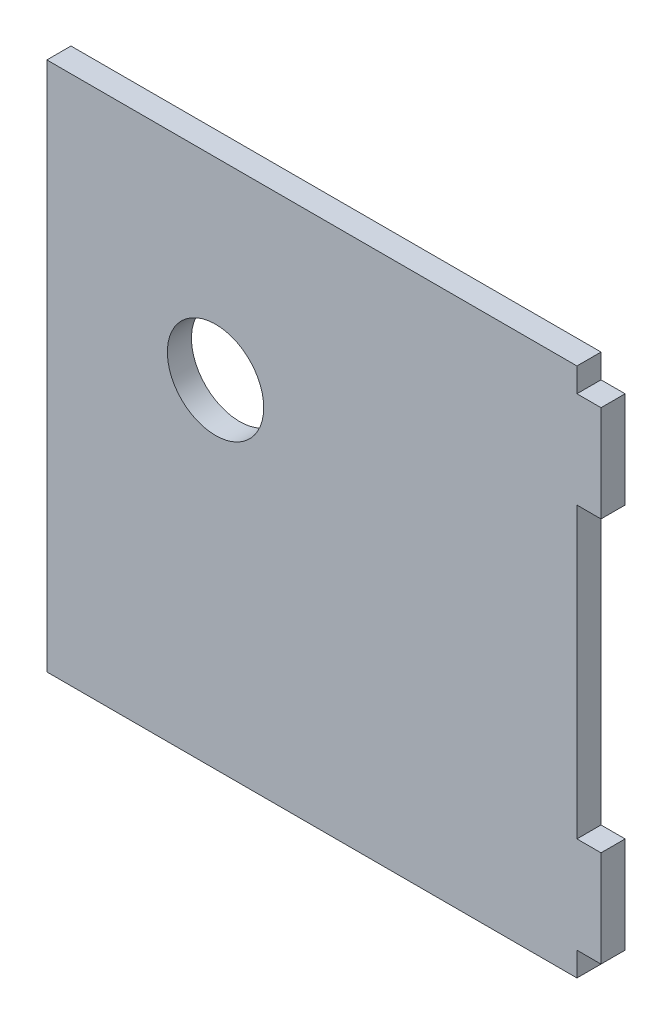
ISO-10303-21;
HEADER;
FILE_DESCRIPTION(('STEP AP214'),'2;1');
FILE_NAME('part.step','',(''),(''),'','','');
FILE_SCHEMA(('AUTOMOTIVE_DESIGN { 1 0 10303 214 1 1 1 1 }'));
ENDSEC;
DATA;
#1=APPLICATION_CONTEXT('core data for automotive mechanical design processes');
#2=APPLICATION_PROTOCOL_DEFINITION('international standard','automotive_design',2000,#1);
#3=PRODUCT_CONTEXT('',#1,'mechanical');
#4=PRODUCT('Part','Part','',(#3));
#5=PRODUCT_RELATED_PRODUCT_CATEGORY('part','',(#4));
#6=PRODUCT_DEFINITION_FORMATION('','',#4);
#7=PRODUCT_DEFINITION_CONTEXT('part definition',#1,'design');
#8=PRODUCT_DEFINITION('design','',#6,#7);
#9=PRODUCT_DEFINITION_SHAPE('','',#8);
#10=(LENGTH_UNIT() NAMED_UNIT(*) SI_UNIT(.MILLI.,.METRE.));
#11=(NAMED_UNIT(*) PLANE_ANGLE_UNIT() SI_UNIT($,.RADIAN.));
#12=(NAMED_UNIT(*) SI_UNIT($,.STERADIAN.) SOLID_ANGLE_UNIT());
#13=UNCERTAINTY_MEASURE_WITH_UNIT(LENGTH_MEASURE(1.E-05),#10,'distance_accuracy_value','');
#14=(GEOMETRIC_REPRESENTATION_CONTEXT(3) GLOBAL_UNCERTAINTY_ASSIGNED_CONTEXT((#13)) GLOBAL_UNIT_ASSIGNED_CONTEXT((#10,
#11,#12)) REPRESENTATION_CONTEXT('',''));
#15=CARTESIAN_POINT('',(0.,0.,0.));
#16=DIRECTION('',(0.,0.,1.));
#17=DIRECTION('',(1.,0.,0.));
#18=AXIS2_PLACEMENT_3D('',#15,#16,#17);
#19=CARTESIAN_POINT('',(0.,0.,6.35));
#20=DIRECTION('',(0.,0.,-1.));
#21=DIRECTION('',(-1.,0.,0.));
#22=AXIS2_PLACEMENT_3D('',#19,#20,#21);
#23=PLANE('',#22);
#24=DIRECTION('',(0.,-1.,0.));
#25=VECTOR('',#24,1.);
#26=CARTESIAN_POINT('',(0.,0.,6.35));
#27=LINE('',#26,#25);
#28=CARTESIAN_POINT('',(0.,139.7,6.35));
#29=VERTEX_POINT('',#28);
#30=CARTESIAN_POINT('',(0.,0.,6.35));
#31=VERTEX_POINT('',#30);
#32=EDGE_CURVE('E177',#29,#31,#27,.T.);
#33=ORIENTED_EDGE('',*,*,#32,.T.);
#34=DIRECTION('',(1.,0.,0.));
#35=VECTOR('',#34,1.);
#36=CARTESIAN_POINT('',(0.,0.,6.35));
#37=LINE('',#36,#35);
#38=CARTESIAN_POINT('',(139.7,0.,6.35));
#39=VERTEX_POINT('',#38);
#40=EDGE_CURVE('E105',#31,#39,#37,.T.);
#41=ORIENTED_EDGE('',*,*,#40,.T.);
#42=DIRECTION('',(0.,1.,0.));
#43=VECTOR('',#42,1.);
#44=CARTESIAN_POINT('',(139.7,0.,6.35));
#45=LINE('',#44,#43);
#46=CARTESIAN_POINT('',(139.7,6.35,6.35));
#47=VERTEX_POINT('',#46);
#48=EDGE_CURVE('E204',#39,#47,#45,.T.);
#49=ORIENTED_EDGE('',*,*,#48,.T.);
#50=DIRECTION('',(1.,0.,0.));
#51=VECTOR('',#50,1.);
#52=CARTESIAN_POINT('',(139.7,6.35,6.35));
#53=LINE('',#52,#51);
#54=CARTESIAN_POINT('',(146.05,6.35,6.35));
#55=VERTEX_POINT('',#54);
#56=EDGE_CURVE('E223',#47,#55,#53,.T.);
#57=ORIENTED_EDGE('',*,*,#56,.T.);
#58=DIRECTION('',(0.,1.,0.));
#59=VECTOR('',#58,1.);
#60=CARTESIAN_POINT('',(146.05,6.35,6.35));
#61=LINE('',#60,#59);
#62=CARTESIAN_POINT('',(146.05,31.75,6.35));
#63=VERTEX_POINT('',#62);
#64=EDGE_CURVE('E220',#55,#63,#61,.T.);
#65=ORIENTED_EDGE('',*,*,#64,.T.);
#66=DIRECTION('',(-1.,0.,0.));
#67=VECTOR('',#66,1.);
#68=CARTESIAN_POINT('',(146.05,31.75,6.35));
#69=LINE('',#68,#67);
#70=CARTESIAN_POINT('',(139.7,31.75,6.35));
#71=VERTEX_POINT('',#70);
#72=EDGE_CURVE('E222',#63,#71,#69,.T.);
#73=ORIENTED_EDGE('',*,*,#72,.T.);
#74=DIRECTION('',(0.,1.,0.));
#75=VECTOR('',#74,1.);
#76=CARTESIAN_POINT('',(139.7,107.95,6.35));
#77=LINE('',#76,#75);
#78=CARTESIAN_POINT('',(139.7,107.95,6.35));
#79=VERTEX_POINT('',#78);
#80=EDGE_CURVE('E225',#71,#79,#77,.T.);
#81=ORIENTED_EDGE('',*,*,#80,.T.);
#82=DIRECTION('',(1.,0.,0.));
#83=VECTOR('',#82,1.);
#84=CARTESIAN_POINT('',(139.7,107.95,6.35));
#85=LINE('',#84,#83);
#86=CARTESIAN_POINT('',(146.05,107.95,6.35));
#87=VERTEX_POINT('',#86);
#88=EDGE_CURVE('E231',#79,#87,#85,.T.);
#89=ORIENTED_EDGE('',*,*,#88,.T.);
#90=DIRECTION('',(0.,1.,0.));
#91=VECTOR('',#90,1.);
#92=CARTESIAN_POINT('',(146.05,133.35,6.35));
#93=LINE('',#92,#91);
#94=CARTESIAN_POINT('',(146.05,133.35,6.35));
#95=VERTEX_POINT('',#94);
#96=EDGE_CURVE('E136',#87,#95,#93,.T.);
#97=ORIENTED_EDGE('',*,*,#96,.T.);
#98=DIRECTION('',(-1.,0.,0.));
#99=VECTOR('',#98,1.);
#100=CARTESIAN_POINT('',(139.7,133.35,6.35));
#101=LINE('',#100,#99);
#102=CARTESIAN_POINT('',(139.7,133.35,6.35));
#103=VERTEX_POINT('',#102);
#104=EDGE_CURVE('E130',#95,#103,#101,.T.);
#105=ORIENTED_EDGE('',*,*,#104,.T.);
#106=DIRECTION('',(0.,1.,0.));
#107=VECTOR('',#106,1.);
#108=CARTESIAN_POINT('',(139.7,133.35,6.35));
#109=LINE('',#108,#107);
#110=CARTESIAN_POINT('',(139.7,139.7,6.35));
#111=VERTEX_POINT('',#110);
#112=EDGE_CURVE('E134',#103,#111,#109,.T.);
#113=ORIENTED_EDGE('',*,*,#112,.T.);
#114=DIRECTION('',(-1.,0.,0.));
#115=VECTOR('',#114,1.);
#116=CARTESIAN_POINT('',(0.,139.7,6.35));
#117=LINE('',#116,#115);
#118=EDGE_CURVE('E50',#111,#29,#117,.T.);
#119=ORIENTED_EDGE('',*,*,#118,.T.);
#120=EDGE_LOOP('',(#33,#41,#49,#57,#65,#73,#81,#89,#97,#105,#113,#119));
#121=FACE_BOUND('',#120,.T.);
#122=CARTESIAN_POINT('',(44.45,88.9,6.35));
#123=DIRECTION('',(0.,0.,1.));
#124=DIRECTION('',(1.,0.,0.));
#125=AXIS2_PLACEMENT_3D('',#122,#123,#124);
#126=CIRCLE('',#125,12.7);
#127=CARTESIAN_POINT('',(57.15,88.9,6.35));
#128=VERTEX_POINT('',#127);
#129=EDGE_CURVE('E158',#128,#128,#126,.T.);
#130=ORIENTED_EDGE('',*,*,#129,.F.);
#131=EDGE_LOOP('',(#130));
#132=FACE_BOUND('',#131,.T.);
#133=ADVANCED_FACE('F33',(#121,#132),#23,.F.);
#134=CARTESIAN_POINT('',(0.,0.,0.));
#135=DIRECTION('',(0.,0.,-1.));
#136=DIRECTION('',(-1.,0.,0.));
#137=AXIS2_PLACEMENT_3D('',#134,#135,#136);
#138=PLANE('',#137);
#139=DIRECTION('',(0.,-1.,0.));
#140=VECTOR('',#139,1.);
#141=CARTESIAN_POINT('',(0.,0.,0.));
#142=LINE('',#141,#140);
#143=CARTESIAN_POINT('',(0.,139.7,0.));
#144=VERTEX_POINT('',#143);
#145=CARTESIAN_POINT('',(0.,0.,0.));
#146=VERTEX_POINT('',#145);
#147=EDGE_CURVE('E154',#144,#146,#142,.T.);
#148=ORIENTED_EDGE('',*,*,#147,.F.);
#149=DIRECTION('',(-1.,0.,0.));
#150=VECTOR('',#149,1.);
#151=CARTESIAN_POINT('',(0.,139.7,0.));
#152=LINE('',#151,#150);
#153=CARTESIAN_POINT('',(139.7,139.7,0.));
#154=VERTEX_POINT('',#153);
#155=EDGE_CURVE('E97',#154,#144,#152,.T.);
#156=ORIENTED_EDGE('',*,*,#155,.F.);
#157=DIRECTION('',(0.,1.,0.));
#158=VECTOR('',#157,1.);
#159=CARTESIAN_POINT('',(139.7,133.35,0.));
#160=LINE('',#159,#158);
#161=CARTESIAN_POINT('',(139.7,133.35,0.));
#162=VERTEX_POINT('',#161);
#163=EDGE_CURVE('E91',#162,#154,#160,.T.);
#164=ORIENTED_EDGE('',*,*,#163,.F.);
#165=DIRECTION('',(-1.,0.,0.));
#166=VECTOR('',#165,1.);
#167=CARTESIAN_POINT('',(139.7,133.35,0.));
#168=LINE('',#167,#166);
#169=CARTESIAN_POINT('',(146.05,133.35,0.));
#170=VERTEX_POINT('',#169);
#171=EDGE_CURVE('E144',#170,#162,#168,.T.);
#172=ORIENTED_EDGE('',*,*,#171,.F.);
#173=DIRECTION('',(0.,1.,0.));
#174=VECTOR('',#173,1.);
#175=CARTESIAN_POINT('',(146.05,133.35,0.));
#176=LINE('',#175,#174);
#177=CARTESIAN_POINT('',(146.05,107.95,0.));
#178=VERTEX_POINT('',#177);
#179=EDGE_CURVE('E172',#178,#170,#176,.T.);
#180=ORIENTED_EDGE('',*,*,#179,.F.);
#181=DIRECTION('',(1.,0.,0.));
#182=VECTOR('',#181,1.);
#183=CARTESIAN_POINT('',(139.7,107.95,0.));
#184=LINE('',#183,#182);
#185=CARTESIAN_POINT('',(139.7,107.95,0.));
#186=VERTEX_POINT('',#185);
#187=EDGE_CURVE('E170',#186,#178,#184,.T.);
#188=ORIENTED_EDGE('',*,*,#187,.F.);
#189=DIRECTION('',(0.,1.,0.));
#190=VECTOR('',#189,1.);
#191=CARTESIAN_POINT('',(139.7,107.95,0.));
#192=LINE('',#191,#190);
#193=CARTESIAN_POINT('',(139.7,31.75,0.));
#194=VERTEX_POINT('',#193);
#195=EDGE_CURVE('E168',#194,#186,#192,.T.);
#196=ORIENTED_EDGE('',*,*,#195,.F.);
#197=DIRECTION('',(-1.,0.,0.));
#198=VECTOR('',#197,1.);
#199=CARTESIAN_POINT('',(146.05,31.75,0.));
#200=LINE('',#199,#198);
#201=CARTESIAN_POINT('',(146.05,31.75,0.));
#202=VERTEX_POINT('',#201);
#203=EDGE_CURVE('E166',#202,#194,#200,.T.);
#204=ORIENTED_EDGE('',*,*,#203,.F.);
#205=DIRECTION('',(0.,1.,0.));
#206=VECTOR('',#205,1.);
#207=CARTESIAN_POINT('',(146.05,6.35,0.));
#208=LINE('',#207,#206);
#209=CARTESIAN_POINT('',(146.05,6.35,0.));
#210=VERTEX_POINT('',#209);
#211=EDGE_CURVE('E164',#210,#202,#208,.T.);
#212=ORIENTED_EDGE('',*,*,#211,.F.);
#213=DIRECTION('',(1.,0.,0.));
#214=VECTOR('',#213,1.);
#215=CARTESIAN_POINT('',(139.7,6.35,0.));
#216=LINE('',#215,#214);
#217=CARTESIAN_POINT('',(139.7,6.35,0.));
#218=VERTEX_POINT('',#217);
#219=EDGE_CURVE('E162',#218,#210,#216,.T.);
#220=ORIENTED_EDGE('',*,*,#219,.F.);
#221=DIRECTION('',(0.,1.,0.));
#222=VECTOR('',#221,1.);
#223=CARTESIAN_POINT('',(139.7,0.,0.));
#224=LINE('',#223,#222);
#225=CARTESIAN_POINT('',(139.7,0.,0.));
#226=VERTEX_POINT('',#225);
#227=EDGE_CURVE('E160',#226,#218,#224,.T.);
#228=ORIENTED_EDGE('',*,*,#227,.F.);
#229=DIRECTION('',(1.,0.,0.));
#230=VECTOR('',#229,1.);
#231=CARTESIAN_POINT('',(0.,0.,0.));
#232=LINE('',#231,#230);
#233=EDGE_CURVE('E157',#146,#226,#232,.T.);
#234=ORIENTED_EDGE('',*,*,#233,.F.);
#235=EDGE_LOOP('',(#148,#156,#164,#172,#180,#188,#196,#204,#212,#220,#228,#234));
#236=FACE_BOUND('',#235,.T.);
#237=CARTESIAN_POINT('',(44.45,88.9,0.));
#238=DIRECTION('',(0.,0.,1.));
#239=DIRECTION('',(1.,0.,0.));
#240=AXIS2_PLACEMENT_3D('',#237,#238,#239);
#241=CIRCLE('',#240,12.7);
#242=CARTESIAN_POINT('',(57.15,88.9,0.));
#243=VERTEX_POINT('',#242);
#244=EDGE_CURVE('E378',#243,#243,#241,.T.);
#245=ORIENTED_EDGE('',*,*,#244,.T.);
#246=EDGE_LOOP('',(#245));
#247=FACE_BOUND('',#246,.T.);
#248=ADVANCED_FACE('F208',(#236,#247),#138,.T.);
#249=CARTESIAN_POINT('',(0.,0.,6.35));
#250=DIRECTION('',(1.,0.,0.));
#251=DIRECTION('',(0.,1.,0.));
#252=AXIS2_PLACEMENT_3D('',#249,#250,#251);
#253=PLANE('',#252);
#254=ORIENTED_EDGE('',*,*,#147,.T.);
#255=DIRECTION('',(0.,0.,-1.));
#256=VECTOR('',#255,1.);
#257=CARTESIAN_POINT('',(0.,0.,6.35));
#258=LINE('',#257,#256);
#259=EDGE_CURVE('E11',#31,#146,#258,.T.);
#260=ORIENTED_EDGE('',*,*,#259,.F.);
#261=ORIENTED_EDGE('',*,*,#32,.F.);
#262=DIRECTION('',(0.,0.,-1.));
#263=VECTOR('',#262,1.);
#264=CARTESIAN_POINT('',(0.,139.7,6.35));
#265=LINE('',#264,#263);
#266=EDGE_CURVE('E150',#29,#144,#265,.T.);
#267=ORIENTED_EDGE('',*,*,#266,.T.);
#268=EDGE_LOOP('',(#254,#260,#261,#267));
#269=FACE_BOUND('',#268,.T.);
#270=ADVANCED_FACE('F35',(#269),#253,.F.);
#271=CARTESIAN_POINT('',(0.,0.,6.35));
#272=DIRECTION('',(0.,1.,0.));
#273=DIRECTION('',(0.,0.,1.));
#274=AXIS2_PLACEMENT_3D('',#271,#272,#273);
#275=PLANE('',#274);
#276=ORIENTED_EDGE('',*,*,#233,.T.);
#277=DIRECTION('',(0.,0.,-1.));
#278=VECTOR('',#277,1.);
#279=CARTESIAN_POINT('',(139.7,0.,6.35));
#280=LINE('',#279,#278);
#281=EDGE_CURVE('E42',#39,#226,#280,.T.);
#282=ORIENTED_EDGE('',*,*,#281,.F.);
#283=ORIENTED_EDGE('',*,*,#40,.F.);
#284=ORIENTED_EDGE('',*,*,#259,.T.);
#285=EDGE_LOOP('',(#276,#282,#283,#284));
#286=FACE_BOUND('',#285,.T.);
#287=ADVANCED_FACE('F265',(#286),#275,.F.);
#288=CARTESIAN_POINT('',(139.7,0.,6.35));
#289=DIRECTION('',(-1.,0.,0.));
#290=DIRECTION('',(0.,0.,1.));
#291=AXIS2_PLACEMENT_3D('',#288,#289,#290);
#292=PLANE('',#291);
#293=ORIENTED_EDGE('',*,*,#227,.T.);
#294=DIRECTION('',(0.,0.,-1.));
#295=VECTOR('',#294,1.);
#296=CARTESIAN_POINT('',(139.7,6.35,6.35));
#297=LINE('',#296,#295);
#298=EDGE_CURVE('E196',#47,#218,#297,.T.);
#299=ORIENTED_EDGE('',*,*,#298,.F.);
#300=ORIENTED_EDGE('',*,*,#48,.F.);
#301=ORIENTED_EDGE('',*,*,#281,.T.);
#302=EDGE_LOOP('',(#293,#299,#300,#301));
#303=FACE_BOUND('',#302,.T.);
#304=ADVANCED_FACE('F202',(#303),#292,.F.);
#305=CARTESIAN_POINT('',(139.7,6.35,6.35));
#306=DIRECTION('',(0.,1.,0.));
#307=DIRECTION('',(0.,0.,1.));
#308=AXIS2_PLACEMENT_3D('',#305,#306,#307);
#309=PLANE('',#308);
#310=ORIENTED_EDGE('',*,*,#219,.T.);
#311=DIRECTION('',(0.,0.,-1.));
#312=VECTOR('',#311,1.);
#313=CARTESIAN_POINT('',(146.05,6.35,6.35));
#314=LINE('',#313,#312);
#315=EDGE_CURVE('E193',#55,#210,#314,.T.);
#316=ORIENTED_EDGE('',*,*,#315,.F.);
#317=ORIENTED_EDGE('',*,*,#56,.F.);
#318=ORIENTED_EDGE('',*,*,#298,.T.);
#319=EDGE_LOOP('',(#310,#316,#317,#318));
#320=FACE_BOUND('',#319,.T.);
#321=ADVANCED_FACE('F214',(#320),#309,.F.);
#322=CARTESIAN_POINT('',(146.05,6.35,6.35));
#323=DIRECTION('',(-1.,0.,0.));
#324=DIRECTION('',(0.,0.,1.));
#325=AXIS2_PLACEMENT_3D('',#322,#323,#324);
#326=PLANE('',#325);
#327=ORIENTED_EDGE('',*,*,#211,.T.);
#328=DIRECTION('',(0.,0.,-1.));
#329=VECTOR('',#328,1.);
#330=CARTESIAN_POINT('',(146.05,31.75,6.35));
#331=LINE('',#330,#329);
#332=EDGE_CURVE('E190',#63,#202,#331,.T.);
#333=ORIENTED_EDGE('',*,*,#332,.F.);
#334=ORIENTED_EDGE('',*,*,#64,.F.);
#335=ORIENTED_EDGE('',*,*,#315,.T.);
#336=EDGE_LOOP('',(#327,#333,#334,#335));
#337=FACE_BOUND('',#336,.T.);
#338=ADVANCED_FACE('F218',(#337),#326,.F.);
#339=CARTESIAN_POINT('',(146.05,31.75,6.35));
#340=DIRECTION('',(0.,-1.,0.));
#341=DIRECTION('',(0.,0.,-1.));
#342=AXIS2_PLACEMENT_3D('',#339,#340,#341);
#343=PLANE('',#342);
#344=ORIENTED_EDGE('',*,*,#203,.T.);
#345=DIRECTION('',(0.,0.,-1.));
#346=VECTOR('',#345,1.);
#347=CARTESIAN_POINT('',(139.7,31.75,6.35));
#348=LINE('',#347,#346);
#349=EDGE_CURVE('E187',#71,#194,#348,.T.);
#350=ORIENTED_EDGE('',*,*,#349,.F.);
#351=ORIENTED_EDGE('',*,*,#72,.F.);
#352=ORIENTED_EDGE('',*,*,#332,.T.);
#353=EDGE_LOOP('',(#344,#350,#351,#352));
#354=FACE_BOUND('',#353,.T.);
#355=ADVANCED_FACE('F278',(#354),#343,.F.);
#356=CARTESIAN_POINT('',(139.7,107.95,6.35));
#357=DIRECTION('',(-1.,0.,0.));
#358=DIRECTION('',(0.,0.,1.));
#359=AXIS2_PLACEMENT_3D('',#356,#357,#358);
#360=PLANE('',#359);
#361=ORIENTED_EDGE('',*,*,#195,.T.);
#362=DIRECTION('',(0.,0.,-1.));
#363=VECTOR('',#362,1.);
#364=CARTESIAN_POINT('',(139.7,107.95,6.35));
#365=LINE('',#364,#363);
#366=EDGE_CURVE('E184',#79,#186,#365,.T.);
#367=ORIENTED_EDGE('',*,*,#366,.F.);
#368=ORIENTED_EDGE('',*,*,#80,.F.);
#369=ORIENTED_EDGE('',*,*,#349,.T.);
#370=EDGE_LOOP('',(#361,#367,#368,#369));
#371=FACE_BOUND('',#370,.T.);
#372=ADVANCED_FACE('F281',(#371),#360,.F.);
#373=CARTESIAN_POINT('',(139.7,107.95,6.35));
#374=DIRECTION('',(0.,1.,0.));
#375=DIRECTION('',(0.,0.,1.));
#376=AXIS2_PLACEMENT_3D('',#373,#374,#375);
#377=PLANE('',#376);
#378=ORIENTED_EDGE('',*,*,#187,.T.);
#379=DIRECTION('',(0.,0.,-1.));
#380=VECTOR('',#379,1.);
#381=CARTESIAN_POINT('',(146.05,107.95,6.35));
#382=LINE('',#381,#380);
#383=EDGE_CURVE('E181',#87,#178,#382,.T.);
#384=ORIENTED_EDGE('',*,*,#383,.F.);
#385=ORIENTED_EDGE('',*,*,#88,.F.);
#386=ORIENTED_EDGE('',*,*,#366,.T.);
#387=EDGE_LOOP('',(#378,#384,#385,#386));
#388=FACE_BOUND('',#387,.T.);
#389=ADVANCED_FACE('F237',(#388),#377,.F.);
#390=CARTESIAN_POINT('',(146.05,133.35,6.35));
#391=DIRECTION('',(-1.,0.,0.));
#392=DIRECTION('',(0.,-1.,0.));
#393=AXIS2_PLACEMENT_3D('',#390,#391,#392);
#394=PLANE('',#393);
#395=ORIENTED_EDGE('',*,*,#179,.T.);
#396=DIRECTION('',(0.,0.,-1.));
#397=VECTOR('',#396,1.);
#398=CARTESIAN_POINT('',(146.05,133.35,6.35));
#399=LINE('',#398,#397);
#400=EDGE_CURVE('E145',#95,#170,#399,.T.);
#401=ORIENTED_EDGE('',*,*,#400,.F.);
#402=ORIENTED_EDGE('',*,*,#96,.F.);
#403=ORIENTED_EDGE('',*,*,#383,.T.);
#404=EDGE_LOOP('',(#395,#401,#402,#403));
#405=FACE_BOUND('',#404,.T.);
#406=ADVANCED_FACE('F241',(#405),#394,.F.);
#407=CARTESIAN_POINT('',(139.7,133.35,6.35));
#408=DIRECTION('',(0.,-1.,0.));
#409=DIRECTION('',(0.,0.,-1.));
#410=AXIS2_PLACEMENT_3D('',#407,#408,#409);
#411=PLANE('',#410);
#412=ORIENTED_EDGE('',*,*,#171,.T.);
#413=DIRECTION('',(0.,0.,-1.));
#414=VECTOR('',#413,1.);
#415=CARTESIAN_POINT('',(139.7,133.35,6.35));
#416=LINE('',#415,#414);
#417=EDGE_CURVE('E141',#103,#162,#416,.T.);
#418=ORIENTED_EDGE('',*,*,#417,.F.);
#419=ORIENTED_EDGE('',*,*,#104,.F.);
#420=ORIENTED_EDGE('',*,*,#400,.T.);
#421=EDGE_LOOP('',(#412,#418,#419,#420));
#422=FACE_BOUND('',#421,.T.);
#423=ADVANCED_FACE('F142',(#422),#411,.F.);
#424=CARTESIAN_POINT('',(139.7,133.35,6.35));
#425=DIRECTION('',(-1.,0.,0.));
#426=DIRECTION('',(0.,0.,1.));
#427=AXIS2_PLACEMENT_3D('',#424,#425,#426);
#428=PLANE('',#427);
#429=ORIENTED_EDGE('',*,*,#163,.T.);
#430=DIRECTION('',(0.,0.,-1.));
#431=VECTOR('',#430,1.);
#432=CARTESIAN_POINT('',(139.7,139.7,6.35));
#433=LINE('',#432,#431);
#434=EDGE_CURVE('E146',#111,#154,#433,.T.);
#435=ORIENTED_EDGE('',*,*,#434,.F.);
#436=ORIENTED_EDGE('',*,*,#112,.F.);
#437=ORIENTED_EDGE('',*,*,#417,.T.);
#438=EDGE_LOOP('',(#429,#435,#436,#437));
#439=FACE_BOUND('',#438,.T.);
#440=ADVANCED_FACE('F148',(#439),#428,.F.);
#441=CARTESIAN_POINT('',(0.,139.7,6.35));
#442=DIRECTION('',(0.,-1.,0.));
#443=DIRECTION('',(0.,0.,-1.));
#444=AXIS2_PLACEMENT_3D('',#441,#442,#443);
#445=PLANE('',#444);
#446=ORIENTED_EDGE('',*,*,#155,.T.);
#447=ORIENTED_EDGE('',*,*,#266,.F.);
#448=ORIENTED_EDGE('',*,*,#118,.F.);
#449=ORIENTED_EDGE('',*,*,#434,.T.);
#450=EDGE_LOOP('',(#446,#447,#448,#449));
#451=FACE_BOUND('',#450,.T.);
#452=ADVANCED_FACE('F245',(#451),#445,.F.);
#453=CARTESIAN_POINT('',(44.45,88.9,6.35));
#454=DIRECTION('',(0.,0.,-1.));
#455=DIRECTION('',(-1.,0.,0.));
#456=AXIS2_PLACEMENT_3D('',#453,#454,#455);
#457=CYLINDRICAL_SURFACE('',#456,12.7);
#458=ORIENTED_EDGE('',*,*,#129,.T.);
#459=EDGE_LOOP('',(#458));
#460=FACE_BOUND('',#459,.T.);
#461=ORIENTED_EDGE('',*,*,#244,.F.);
#462=EDGE_LOOP('',(#461));
#463=FACE_BOUND('',#462,.T.);
#464=ADVANCED_FACE('F247',(#460,#463),#457,.F.);
#465=CLOSED_SHELL('',(#133,#248,#270,#287,#304,#321,#338,#355,#372,#389,#406,#423,#440,#452,#464));
#466=MANIFOLD_SOLID_BREP('B2',#465);
#467=ADVANCED_BREP_SHAPE_REPRESENTATION('',(#18,#466),#14);
#468=SHAPE_DEFINITION_REPRESENTATION(#9,#467);
ENDSEC;
END-ISO-10303-21;
